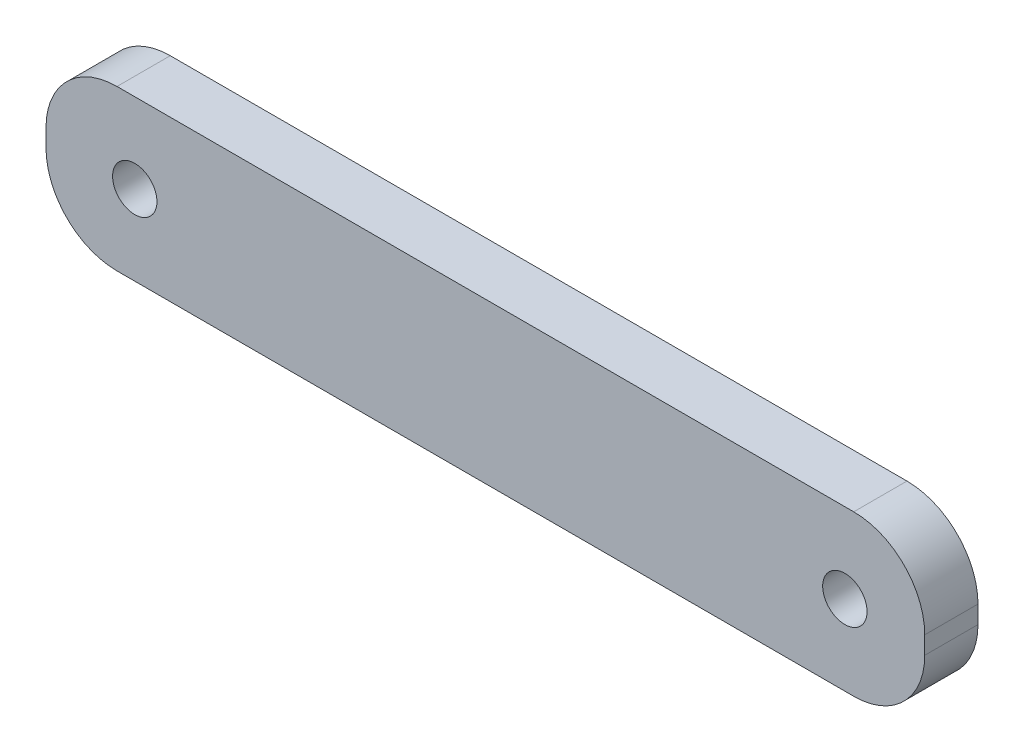
ISO-10303-21;
HEADER;
FILE_DESCRIPTION(('STEP AP214'),'2;1');
FILE_NAME('part.step','',(''),(''),'','','');
FILE_SCHEMA(('AUTOMOTIVE_DESIGN { 1 0 10303 214 1 1 1 1 }'));
ENDSEC;
DATA;
#1=APPLICATION_CONTEXT('core data for automotive mechanical design processes');
#2=APPLICATION_PROTOCOL_DEFINITION('international standard','automotive_design',2000,#1);
#3=PRODUCT_CONTEXT('',#1,'mechanical');
#4=PRODUCT('Part','Part','',(#3));
#5=PRODUCT_RELATED_PRODUCT_CATEGORY('part','',(#4));
#6=PRODUCT_DEFINITION_FORMATION('','',#4);
#7=PRODUCT_DEFINITION_CONTEXT('part definition',#1,'design');
#8=PRODUCT_DEFINITION('design','',#6,#7);
#9=PRODUCT_DEFINITION_SHAPE('','',#8);
#10=(LENGTH_UNIT() NAMED_UNIT(*) SI_UNIT(.MILLI.,.METRE.));
#11=(NAMED_UNIT(*) PLANE_ANGLE_UNIT() SI_UNIT($,.RADIAN.));
#12=(NAMED_UNIT(*) SI_UNIT($,.STERADIAN.) SOLID_ANGLE_UNIT());
#13=UNCERTAINTY_MEASURE_WITH_UNIT(LENGTH_MEASURE(1.E-05),#10,'distance_accuracy_value','');
#14=(GEOMETRIC_REPRESENTATION_CONTEXT(3) GLOBAL_UNCERTAINTY_ASSIGNED_CONTEXT((#13)) GLOBAL_UNIT_ASSIGNED_CONTEXT((#10,
#11,#12)) REPRESENTATION_CONTEXT('',''));
#15=CARTESIAN_POINT('',(0.,0.,0.));
#16=DIRECTION('',(0.,0.,1.));
#17=DIRECTION('',(1.,0.,0.));
#18=AXIS2_PLACEMENT_3D('',#15,#16,#17);
#19=CARTESIAN_POINT('',(0.,0.,-3.));
#20=DIRECTION('',(-1.,0.,0.));
#21=DIRECTION('',(0.,0.,1.));
#22=AXIS2_PLACEMENT_3D('',#19,#20,#21);
#23=PLANE('',#22);
#24=DIRECTION('',(0.,-1.,0.));
#25=VECTOR('',#24,1.);
#26=CARTESIAN_POINT('',(0.,0.,-3.));
#27=LINE('',#26,#25);
#28=CARTESIAN_POINT('',(0.,5.,-3.));
#29=VERTEX_POINT('',#28);
#30=CARTESIAN_POINT('',(0.,4.,-3.));
#31=VERTEX_POINT('',#30);
#32=EDGE_CURVE('E158',#29,#31,#27,.T.);
#33=ORIENTED_EDGE('',*,*,#32,.T.);
#34=DIRECTION('',(0.,0.,1.));
#35=VECTOR('',#34,1.);
#36=CARTESIAN_POINT('',(0.,4.,-3.));
#37=LINE('',#36,#35);
#38=CARTESIAN_POINT('',(0.,4.,0.));
#39=VERTEX_POINT('',#38);
#40=EDGE_CURVE('E11',#31,#39,#37,.T.);
#41=ORIENTED_EDGE('',*,*,#40,.T.);
#42=DIRECTION('',(0.,-1.,0.));
#43=VECTOR('',#42,1.);
#44=CARTESIAN_POINT('',(0.,0.,0.));
#45=LINE('',#44,#43);
#46=CARTESIAN_POINT('',(0.,5.,0.));
#47=VERTEX_POINT('',#46);
#48=EDGE_CURVE('E161',#47,#39,#45,.T.);
#49=ORIENTED_EDGE('',*,*,#48,.F.);
#50=DIRECTION('',(0.,0.,1.));
#51=VECTOR('',#50,1.);
#52=CARTESIAN_POINT('',(0.,5.,-3.));
#53=LINE('',#52,#51);
#54=EDGE_CURVE('E46',#47,#29,#53,.F.);
#55=ORIENTED_EDGE('',*,*,#54,.T.);
#56=EDGE_LOOP('',(#33,#41,#49,#55));
#57=FACE_BOUND('',#56,.T.);
#58=ADVANCED_FACE('F38',(#57),#23,.T.);
#59=CARTESIAN_POINT('',(0.,9.,-3.));
#60=DIRECTION('',(0.,1.,0.));
#61=DIRECTION('',(0.,0.,1.));
#62=AXIS2_PLACEMENT_3D('',#59,#60,#61);
#63=PLANE('',#62);
#64=DIRECTION('',(-1.,0.,0.));
#65=VECTOR('',#64,1.);
#66=CARTESIAN_POINT('',(0.,9.,0.));
#67=LINE('',#66,#65);
#68=CARTESIAN_POINT('',(45.5,9.,0.));
#69=VERTEX_POINT('',#68);
#70=CARTESIAN_POINT('',(4.,9.,0.));
#71=VERTEX_POINT('',#70);
#72=EDGE_CURVE('E124',#69,#71,#67,.T.);
#73=ORIENTED_EDGE('',*,*,#72,.F.);
#74=DIRECTION('',(0.,0.,1.));
#75=VECTOR('',#74,1.);
#76=CARTESIAN_POINT('',(45.5,9.,-3.));
#77=LINE('',#76,#75);
#78=CARTESIAN_POINT('',(45.5,9.,-3.));
#79=VERTEX_POINT('',#78);
#80=EDGE_CURVE('E142',#69,#79,#77,.F.);
#81=ORIENTED_EDGE('',*,*,#80,.T.);
#82=DIRECTION('',(-1.,0.,0.));
#83=VECTOR('',#82,1.);
#84=CARTESIAN_POINT('',(0.,9.,-3.));
#85=LINE('',#84,#83);
#86=CARTESIAN_POINT('',(4.,9.,-3.));
#87=VERTEX_POINT('',#86);
#88=EDGE_CURVE('E127',#79,#87,#85,.T.);
#89=ORIENTED_EDGE('',*,*,#88,.T.);
#90=DIRECTION('',(0.,0.,1.));
#91=VECTOR('',#90,1.);
#92=CARTESIAN_POINT('',(4.,9.,-3.));
#93=LINE('',#92,#91);
#94=EDGE_CURVE('E139',#87,#71,#93,.T.);
#95=ORIENTED_EDGE('',*,*,#94,.T.);
#96=EDGE_LOOP('',(#73,#81,#89,#95));
#97=FACE_BOUND('',#96,.T.);
#98=ADVANCED_FACE('F173',(#97),#63,.T.);
#99=CARTESIAN_POINT('',(49.5,0.,-3.));
#100=DIRECTION('',(1.,0.,0.));
#101=DIRECTION('',(0.,0.,-1.));
#102=AXIS2_PLACEMENT_3D('',#99,#100,#101);
#103=PLANE('',#102);
#104=DIRECTION('',(0.,1.,0.));
#105=VECTOR('',#104,1.);
#106=CARTESIAN_POINT('',(49.5,0.,-3.));
#107=LINE('',#106,#105);
#108=CARTESIAN_POINT('',(49.5,4.,-3.));
#109=VERTEX_POINT('',#108);
#110=CARTESIAN_POINT('',(49.5,5.,-3.));
#111=VERTEX_POINT('',#110);
#112=EDGE_CURVE('E132',#109,#111,#107,.T.);
#113=ORIENTED_EDGE('',*,*,#112,.T.);
#114=DIRECTION('',(0.,0.,1.));
#115=VECTOR('',#114,1.);
#116=CARTESIAN_POINT('',(49.5,5.,-3.));
#117=LINE('',#116,#115);
#118=CARTESIAN_POINT('',(49.5,5.,0.));
#119=VERTEX_POINT('',#118);
#120=EDGE_CURVE('E123',#111,#119,#117,.T.);
#121=ORIENTED_EDGE('',*,*,#120,.T.);
#122=DIRECTION('',(0.,1.,0.));
#123=VECTOR('',#122,1.);
#124=CARTESIAN_POINT('',(49.5,0.,0.));
#125=LINE('',#124,#123);
#126=CARTESIAN_POINT('',(49.5,4.,0.));
#127=VERTEX_POINT('',#126);
#128=EDGE_CURVE('E108',#127,#119,#125,.T.);
#129=ORIENTED_EDGE('',*,*,#128,.F.);
#130=DIRECTION('',(0.,0.,1.));
#131=VECTOR('',#130,1.);
#132=CARTESIAN_POINT('',(49.5,4.,-3.));
#133=LINE('',#132,#131);
#134=EDGE_CURVE('E121',#127,#109,#133,.F.);
#135=ORIENTED_EDGE('',*,*,#134,.T.);
#136=EDGE_LOOP('',(#113,#121,#129,#135));
#137=FACE_BOUND('',#136,.T.);
#138=ADVANCED_FACE('F120',(#137),#103,.T.);
#139=CARTESIAN_POINT('',(0.,0.,-3.));
#140=DIRECTION('',(0.,-1.,0.));
#141=DIRECTION('',(0.,0.,-1.));
#142=AXIS2_PLACEMENT_3D('',#139,#140,#141);
#143=PLANE('',#142);
#144=DIRECTION('',(1.,0.,0.));
#145=VECTOR('',#144,1.);
#146=CARTESIAN_POINT('',(0.,0.,-3.));
#147=LINE('',#146,#145);
#148=CARTESIAN_POINT('',(4.,0.,-3.));
#149=VERTEX_POINT('',#148);
#150=CARTESIAN_POINT('',(45.5,0.,-3.));
#151=VERTEX_POINT('',#150);
#152=EDGE_CURVE('E167',#149,#151,#147,.T.);
#153=ORIENTED_EDGE('',*,*,#152,.T.);
#154=DIRECTION('',(0.,0.,1.));
#155=VECTOR('',#154,1.);
#156=CARTESIAN_POINT('',(45.5,0.,-3.));
#157=LINE('',#156,#155);
#158=CARTESIAN_POINT('',(45.5,0.,0.));
#159=VERTEX_POINT('',#158);
#160=EDGE_CURVE('E152',#151,#159,#157,.T.);
#161=ORIENTED_EDGE('',*,*,#160,.T.);
#162=DIRECTION('',(1.,0.,0.));
#163=VECTOR('',#162,1.);
#164=CARTESIAN_POINT('',(0.,0.,0.));
#165=LINE('',#164,#163);
#166=CARTESIAN_POINT('',(4.,0.,0.));
#167=VERTEX_POINT('',#166);
#168=EDGE_CURVE('E109',#167,#159,#165,.T.);
#169=ORIENTED_EDGE('',*,*,#168,.F.);
#170=DIRECTION('',(0.,0.,1.));
#171=VECTOR('',#170,1.);
#172=CARTESIAN_POINT('',(4.,0.,-3.));
#173=LINE('',#172,#171);
#174=EDGE_CURVE('E60',#167,#149,#173,.F.);
#175=ORIENTED_EDGE('',*,*,#174,.T.);
#176=EDGE_LOOP('',(#153,#161,#169,#175));
#177=FACE_BOUND('',#176,.T.);
#178=ADVANCED_FACE('F225',(#177),#143,.T.);
#179=CARTESIAN_POINT('',(0.,0.,-3.));
#180=DIRECTION('',(0.,0.,-1.));
#181=DIRECTION('',(-1.,0.,0.));
#182=AXIS2_PLACEMENT_3D('',#179,#180,#181);
#183=PLANE('',#182);
#184=CARTESIAN_POINT('',(45.,4.5,-3.));
#185=DIRECTION('',(0.,0.,1.));
#186=DIRECTION('',(1.,0.,0.));
#187=AXIS2_PLACEMENT_3D('',#184,#185,#186);
#188=CIRCLE('',#187,1.25);
#189=CARTESIAN_POINT('',(46.25,4.5,-3.));
#190=VERTEX_POINT('',#189);
#191=EDGE_CURVE('E189',#190,#190,#188,.T.);
#192=ORIENTED_EDGE('',*,*,#191,.T.);
#193=EDGE_LOOP('',(#192));
#194=FACE_BOUND('',#193,.T.);
#195=CARTESIAN_POINT('',(5.,4.5,-3.));
#196=DIRECTION('',(0.,0.,1.));
#197=DIRECTION('',(1.,0.,0.));
#198=AXIS2_PLACEMENT_3D('',#195,#196,#197);
#199=CIRCLE('',#198,1.25);
#200=CARTESIAN_POINT('',(6.25,4.5,-3.));
#201=VERTEX_POINT('',#200);
#202=EDGE_CURVE('E182',#201,#201,#199,.T.);
#203=ORIENTED_EDGE('',*,*,#202,.T.);
#204=EDGE_LOOP('',(#203));
#205=FACE_BOUND('',#204,.T.);
#206=ORIENTED_EDGE('',*,*,#88,.F.);
#207=CARTESIAN_POINT('',(45.5,5.,-3.));
#208=DIRECTION('',(0.,0.,-1.));
#209=DIRECTION('',(-1.,0.,0.));
#210=AXIS2_PLACEMENT_3D('',#207,#208,#209);
#211=CIRCLE('',#210,4.);
#212=EDGE_CURVE('E149',#79,#111,#211,.T.);
#213=ORIENTED_EDGE('',*,*,#212,.T.);
#214=ORIENTED_EDGE('',*,*,#112,.F.);
#215=CARTESIAN_POINT('',(45.5,4.,-3.));
#216=DIRECTION('',(0.,0.,-1.));
#217=DIRECTION('',(-1.,0.,0.));
#218=AXIS2_PLACEMENT_3D('',#215,#216,#217);
#219=CIRCLE('',#218,4.);
#220=EDGE_CURVE('E53',#109,#151,#219,.T.);
#221=ORIENTED_EDGE('',*,*,#220,.T.);
#222=ORIENTED_EDGE('',*,*,#152,.F.);
#223=CARTESIAN_POINT('',(4.,4.,-3.));
#224=DIRECTION('',(0.,0.,-1.));
#225=DIRECTION('',(-1.,0.,0.));
#226=AXIS2_PLACEMENT_3D('',#223,#224,#225);
#227=CIRCLE('',#226,4.);
#228=EDGE_CURVE('E146',#149,#31,#227,.T.);
#229=ORIENTED_EDGE('',*,*,#228,.T.);
#230=ORIENTED_EDGE('',*,*,#32,.F.);
#231=CARTESIAN_POINT('',(4.,5.,-3.));
#232=DIRECTION('',(0.,0.,-1.));
#233=DIRECTION('',(-1.,0.,0.));
#234=AXIS2_PLACEMENT_3D('',#231,#232,#233);
#235=CIRCLE('',#234,4.);
#236=EDGE_CURVE('E144',#29,#87,#235,.T.);
#237=ORIENTED_EDGE('',*,*,#236,.T.);
#238=EDGE_LOOP('',(#206,#213,#214,#221,#222,#229,#230,#237));
#239=FACE_BOUND('',#238,.T.);
#240=ADVANCED_FACE('F165',(#194,#205,#239),#183,.T.);
#241=CARTESIAN_POINT('',(0.,0.,0.));
#242=DIRECTION('',(0.,0.,-1.));
#243=DIRECTION('',(-1.,0.,0.));
#244=AXIS2_PLACEMENT_3D('',#241,#242,#243);
#245=PLANE('',#244);
#246=CARTESIAN_POINT('',(45.,4.5,0.));
#247=DIRECTION('',(0.,0.,1.));
#248=DIRECTION('',(1.,0.,0.));
#249=AXIS2_PLACEMENT_3D('',#246,#247,#248);
#250=CIRCLE('',#249,1.25);
#251=CARTESIAN_POINT('',(46.25,4.5,0.));
#252=VERTEX_POINT('',#251);
#253=EDGE_CURVE('E192',#252,#252,#250,.T.);
#254=ORIENTED_EDGE('',*,*,#253,.F.);
#255=EDGE_LOOP('',(#254));
#256=FACE_BOUND('',#255,.T.);
#257=CARTESIAN_POINT('',(5.,4.5,0.));
#258=DIRECTION('',(0.,0.,1.));
#259=DIRECTION('',(1.,0.,0.));
#260=AXIS2_PLACEMENT_3D('',#257,#258,#259);
#261=CIRCLE('',#260,1.25);
#262=CARTESIAN_POINT('',(6.25,4.5,0.));
#263=VERTEX_POINT('',#262);
#264=EDGE_CURVE('E184',#263,#263,#261,.T.);
#265=ORIENTED_EDGE('',*,*,#264,.F.);
#266=EDGE_LOOP('',(#265));
#267=FACE_BOUND('',#266,.T.);
#268=ORIENTED_EDGE('',*,*,#128,.T.);
#269=CARTESIAN_POINT('',(45.5,5.,0.));
#270=DIRECTION('',(0.,0.,-1.));
#271=DIRECTION('',(-1.,0.,0.));
#272=AXIS2_PLACEMENT_3D('',#269,#270,#271);
#273=CIRCLE('',#272,4.);
#274=EDGE_CURVE('E114',#119,#69,#273,.F.);
#275=ORIENTED_EDGE('',*,*,#274,.T.);
#276=ORIENTED_EDGE('',*,*,#72,.T.);
#277=CARTESIAN_POINT('',(4.,5.,0.));
#278=DIRECTION('',(0.,0.,-1.));
#279=DIRECTION('',(-1.,0.,0.));
#280=AXIS2_PLACEMENT_3D('',#277,#278,#279);
#281=CIRCLE('',#280,4.);
#282=EDGE_CURVE('E129',#71,#47,#281,.F.);
#283=ORIENTED_EDGE('',*,*,#282,.T.);
#284=ORIENTED_EDGE('',*,*,#48,.T.);
#285=CARTESIAN_POINT('',(4.,4.,0.));
#286=DIRECTION('',(0.,0.,-1.));
#287=DIRECTION('',(-1.,0.,0.));
#288=AXIS2_PLACEMENT_3D('',#285,#286,#287);
#289=CIRCLE('',#288,4.);
#290=EDGE_CURVE('E115',#39,#167,#289,.F.);
#291=ORIENTED_EDGE('',*,*,#290,.T.);
#292=ORIENTED_EDGE('',*,*,#168,.T.);
#293=CARTESIAN_POINT('',(45.5,4.,0.));
#294=DIRECTION('',(0.,0.,-1.));
#295=DIRECTION('',(-1.,0.,0.));
#296=AXIS2_PLACEMENT_3D('',#293,#294,#295);
#297=CIRCLE('',#296,4.);
#298=EDGE_CURVE('E105',#159,#127,#297,.F.);
#299=ORIENTED_EDGE('',*,*,#298,.T.);
#300=EDGE_LOOP('',(#268,#275,#276,#283,#284,#291,#292,#299));
#301=FACE_BOUND('',#300,.T.);
#302=ADVANCED_FACE('F107',(#256,#267,#301),#245,.F.);
#303=CARTESIAN_POINT('',(5.,4.5,-3.));
#304=DIRECTION('',(0.,0.,1.));
#305=DIRECTION('',(1.,0.,0.));
#306=AXIS2_PLACEMENT_3D('',#303,#304,#305);
#307=CYLINDRICAL_SURFACE('',#306,1.25);
#308=ORIENTED_EDGE('',*,*,#202,.F.);
#309=EDGE_LOOP('',(#308));
#310=FACE_BOUND('',#309,.T.);
#311=ORIENTED_EDGE('',*,*,#264,.T.);
#312=EDGE_LOOP('',(#311));
#313=FACE_BOUND('',#312,.T.);
#314=ADVANCED_FACE('F202',(#310,#313),#307,.F.);
#315=CARTESIAN_POINT('',(45.,4.5,-3.));
#316=DIRECTION('',(0.,0.,1.));
#317=DIRECTION('',(1.,0.,0.));
#318=AXIS2_PLACEMENT_3D('',#315,#316,#317);
#319=CYLINDRICAL_SURFACE('',#318,1.25);
#320=ORIENTED_EDGE('',*,*,#191,.F.);
#321=EDGE_LOOP('',(#320));
#322=FACE_BOUND('',#321,.T.);
#323=ORIENTED_EDGE('',*,*,#253,.T.);
#324=EDGE_LOOP('',(#323));
#325=FACE_BOUND('',#324,.T.);
#326=ADVANCED_FACE('F199',(#322,#325),#319,.F.);
#327=CARTESIAN_POINT('',(45.5,5.,-3.));
#328=DIRECTION('',(0.,0.,1.));
#329=DIRECTION('',(1.,0.,0.));
#330=AXIS2_PLACEMENT_3D('',#327,#328,#329);
#331=CYLINDRICAL_SURFACE('',#330,4.);
#332=ORIENTED_EDGE('',*,*,#212,.F.);
#333=ORIENTED_EDGE('',*,*,#80,.F.);
#334=ORIENTED_EDGE('',*,*,#274,.F.);
#335=ORIENTED_EDGE('',*,*,#120,.F.);
#336=EDGE_LOOP('',(#332,#333,#334,#335));
#337=FACE_BOUND('',#336,.T.);
#338=ADVANCED_FACE('F177',(#337),#331,.T.);
#339=CARTESIAN_POINT('',(45.5,4.,-3.));
#340=DIRECTION('',(0.,0.,1.));
#341=DIRECTION('',(1.,0.,0.));
#342=AXIS2_PLACEMENT_3D('',#339,#340,#341);
#343=CYLINDRICAL_SURFACE('',#342,4.);
#344=ORIENTED_EDGE('',*,*,#220,.F.);
#345=ORIENTED_EDGE('',*,*,#134,.F.);
#346=ORIENTED_EDGE('',*,*,#298,.F.);
#347=ORIENTED_EDGE('',*,*,#160,.F.);
#348=EDGE_LOOP('',(#344,#345,#346,#347));
#349=FACE_BOUND('',#348,.T.);
#350=ADVANCED_FACE('F126',(#349),#343,.T.);
#351=CARTESIAN_POINT('',(4.,4.,-3.));
#352=DIRECTION('',(0.,0.,1.));
#353=DIRECTION('',(1.,0.,0.));
#354=AXIS2_PLACEMENT_3D('',#351,#352,#353);
#355=CYLINDRICAL_SURFACE('',#354,4.);
#356=ORIENTED_EDGE('',*,*,#228,.F.);
#357=ORIENTED_EDGE('',*,*,#174,.F.);
#358=ORIENTED_EDGE('',*,*,#290,.F.);
#359=ORIENTED_EDGE('',*,*,#40,.F.);
#360=EDGE_LOOP('',(#356,#357,#358,#359));
#361=FACE_BOUND('',#360,.T.);
#362=ADVANCED_FACE('F230',(#361),#355,.T.);
#363=CARTESIAN_POINT('',(4.,5.,-3.));
#364=DIRECTION('',(0.,0.,1.));
#365=DIRECTION('',(1.,0.,0.));
#366=AXIS2_PLACEMENT_3D('',#363,#364,#365);
#367=CYLINDRICAL_SURFACE('',#366,4.);
#368=ORIENTED_EDGE('',*,*,#236,.F.);
#369=ORIENTED_EDGE('',*,*,#54,.F.);
#370=ORIENTED_EDGE('',*,*,#282,.F.);
#371=ORIENTED_EDGE('',*,*,#94,.F.);
#372=EDGE_LOOP('',(#368,#369,#370,#371));
#373=FACE_BOUND('',#372,.T.);
#374=ADVANCED_FACE('F40',(#373),#367,.T.);
#375=CLOSED_SHELL('',(#58,#98,#138,#178,#240,#302,#314,#326,#338,#350,#362,#374));
#376=MANIFOLD_SOLID_BREP('B2',#375);
#377=ADVANCED_BREP_SHAPE_REPRESENTATION('',(#18,#376),#14);
#378=SHAPE_DEFINITION_REPRESENTATION(#9,#377);
ENDSEC;
END-ISO-10303-21;
